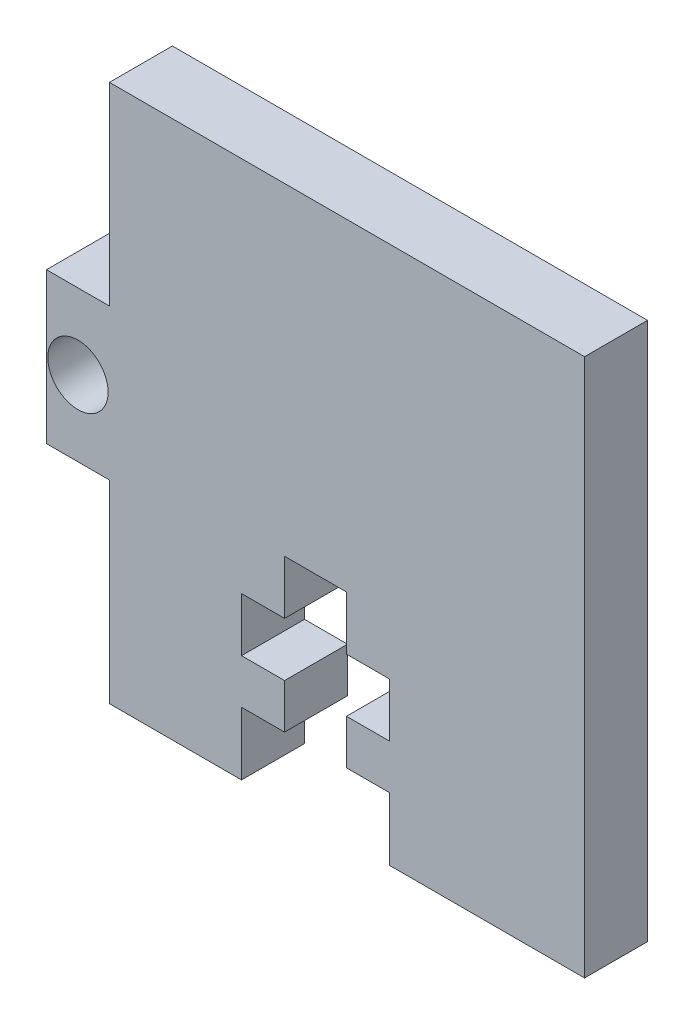
ISO-10303-21;
HEADER;
FILE_DESCRIPTION(('STEP AP214'),'2;1');
FILE_NAME('part.step','',(''),(''),'','','');
FILE_SCHEMA(('AUTOMOTIVE_DESIGN { 1 0 10303 214 1 1 1 1 }'));
ENDSEC;
DATA;
#1=APPLICATION_CONTEXT('core data for automotive mechanical design processes');
#2=APPLICATION_PROTOCOL_DEFINITION('international standard','automotive_design',2000,#1);
#3=PRODUCT_CONTEXT('',#1,'mechanical');
#4=PRODUCT('Part','Part','',(#3));
#5=PRODUCT_RELATED_PRODUCT_CATEGORY('part','',(#4));
#6=PRODUCT_DEFINITION_FORMATION('','',#4);
#7=PRODUCT_DEFINITION_CONTEXT('part definition',#1,'design');
#8=PRODUCT_DEFINITION('design','',#6,#7);
#9=PRODUCT_DEFINITION_SHAPE('','',#8);
#10=(LENGTH_UNIT() NAMED_UNIT(*) SI_UNIT(.MILLI.,.METRE.));
#11=(NAMED_UNIT(*) PLANE_ANGLE_UNIT() SI_UNIT($,.RADIAN.));
#12=(NAMED_UNIT(*) SI_UNIT($,.STERADIAN.) SOLID_ANGLE_UNIT());
#13=UNCERTAINTY_MEASURE_WITH_UNIT(LENGTH_MEASURE(1.E-05),#10,'distance_accuracy_value','');
#14=(GEOMETRIC_REPRESENTATION_CONTEXT(3) GLOBAL_UNCERTAINTY_ASSIGNED_CONTEXT((#13)) GLOBAL_UNIT_ASSIGNED_CONTEXT((#10,
#11,#12)) REPRESENTATION_CONTEXT('',''));
#15=CARTESIAN_POINT('',(0.,0.,0.));
#16=DIRECTION('',(0.,0.,1.));
#17=DIRECTION('',(1.,0.,0.));
#18=AXIS2_PLACEMENT_3D('',#15,#16,#17);
#19=CARTESIAN_POINT('',(0.,10.16,2.9718));
#20=DIRECTION('',(0.,1.,0.));
#21=DIRECTION('',(0.,0.,1.));
#22=AXIS2_PLACEMENT_3D('',#19,#20,#21);
#23=PLANE('',#22);
#24=DIRECTION('',(1.,0.,0.));
#25=VECTOR('',#24,1.);
#26=CARTESIAN_POINT('',(0.,10.16,0.));
#27=LINE('',#26,#25);
#28=CARTESIAN_POINT('',(11.2395,10.16,0.));
#29=VERTEX_POINT('',#28);
#30=CARTESIAN_POINT('',(14.1605,10.16,0.));
#31=VERTEX_POINT('',#30);
#32=EDGE_CURVE('E234',#29,#31,#27,.T.);
#33=ORIENTED_EDGE('',*,*,#32,.T.);
#34=DIRECTION('',(0.,0.,-1.));
#35=VECTOR('',#34,1.);
#36=CARTESIAN_POINT('',(14.1605,10.16,2.9718));
#37=LINE('',#36,#35);
#38=CARTESIAN_POINT('',(14.1605,10.16,2.9718));
#39=VERTEX_POINT('',#38);
#40=EDGE_CURVE('E11',#39,#31,#37,.T.);
#41=ORIENTED_EDGE('',*,*,#40,.F.);
#42=DIRECTION('',(1.,0.,0.));
#43=VECTOR('',#42,1.);
#44=CARTESIAN_POINT('',(0.,10.16,2.9718));
#45=LINE('',#44,#43);
#46=CARTESIAN_POINT('',(11.2395,10.16,2.9718));
#47=VERTEX_POINT('',#46);
#48=EDGE_CURVE('E143',#47,#39,#45,.T.);
#49=ORIENTED_EDGE('',*,*,#48,.F.);
#50=DIRECTION('',(0.,0.,-1.));
#51=VECTOR('',#50,1.);
#52=CARTESIAN_POINT('',(11.2395,10.16,2.9718));
#53=LINE('',#52,#51);
#54=EDGE_CURVE('E233',#47,#29,#53,.T.);
#55=ORIENTED_EDGE('',*,*,#54,.T.);
#56=EDGE_LOOP('',(#33,#41,#49,#55));
#57=FACE_BOUND('',#56,.T.);
#58=ADVANCED_FACE('F39',(#57),#23,.F.);
#59=CARTESIAN_POINT('',(14.1605,0.,2.9718));
#60=DIRECTION('',(-1.,0.,0.));
#61=DIRECTION('',(0.,0.,1.));
#62=AXIS2_PLACEMENT_3D('',#59,#60,#61);
#63=PLANE('',#62);
#64=DIRECTION('',(0.,1.,0.));
#65=VECTOR('',#64,1.);
#66=CARTESIAN_POINT('',(14.1605,0.,0.));
#67=LINE('',#66,#65);
#68=CARTESIAN_POINT('',(14.1605,7.62,0.));
#69=VERTEX_POINT('',#68);
#70=EDGE_CURVE('E237',#69,#31,#67,.T.);
#71=ORIENTED_EDGE('',*,*,#70,.F.);
#72=DIRECTION('',(0.,0.,-1.));
#73=VECTOR('',#72,1.);
#74=CARTESIAN_POINT('',(14.1605,7.62,2.9718));
#75=LINE('',#74,#73);
#76=CARTESIAN_POINT('',(14.1605,7.62,2.9718));
#77=VERTEX_POINT('',#76);
#78=EDGE_CURVE('E47',#77,#69,#75,.T.);
#79=ORIENTED_EDGE('',*,*,#78,.F.);
#80=DIRECTION('',(0.,1.,0.));
#81=VECTOR('',#80,1.);
#82=CARTESIAN_POINT('',(14.1605,0.,2.9718));
#83=LINE('',#82,#81);
#84=EDGE_CURVE('E363',#77,#39,#83,.T.);
#85=ORIENTED_EDGE('',*,*,#84,.T.);
#86=ORIENTED_EDGE('',*,*,#40,.T.);
#87=EDGE_LOOP('',(#71,#79,#85,#86));
#88=FACE_BOUND('',#87,.T.);
#89=ADVANCED_FACE('F349',(#88),#63,.T.);
#90=CARTESIAN_POINT('',(0.,7.61999999999999,2.9718));
#91=DIRECTION('',(0.,-1.,0.));
#92=DIRECTION('',(1.,0.,0.));
#93=AXIS2_PLACEMENT_3D('',#90,#91,#92);
#94=PLANE('',#93);
#95=DIRECTION('',(-1.,0.,0.));
#96=VECTOR('',#95,1.);
#97=CARTESIAN_POINT('',(0.,7.61999999999999,0.));
#98=LINE('',#97,#96);
#99=CARTESIAN_POINT('',(16.1925,7.62,0.));
#100=VERTEX_POINT('',#99);
#101=EDGE_CURVE('E240',#100,#69,#98,.T.);
#102=ORIENTED_EDGE('',*,*,#101,.F.);
#103=DIRECTION('',(0.,0.,-1.));
#104=VECTOR('',#103,1.);
#105=CARTESIAN_POINT('',(16.1925,7.62,2.9718));
#106=LINE('',#105,#104);
#107=CARTESIAN_POINT('',(16.1925,7.62,2.9718));
#108=VERTEX_POINT('',#107);
#109=EDGE_CURVE('E339',#108,#100,#106,.T.);
#110=ORIENTED_EDGE('',*,*,#109,.F.);
#111=DIRECTION('',(-1.,0.,0.));
#112=VECTOR('',#111,1.);
#113=CARTESIAN_POINT('',(0.,7.61999999999999,2.9718));
#114=LINE('',#113,#112);
#115=EDGE_CURVE('E346',#108,#77,#114,.T.);
#116=ORIENTED_EDGE('',*,*,#115,.T.);
#117=ORIENTED_EDGE('',*,*,#78,.T.);
#118=EDGE_LOOP('',(#102,#110,#116,#117));
#119=FACE_BOUND('',#118,.T.);
#120=ADVANCED_FACE('F344',(#119),#94,.T.);
#121=CARTESIAN_POINT('',(16.1925,0.,2.9718));
#122=DIRECTION('',(-1.,0.,0.));
#123=DIRECTION('',(0.,0.,1.));
#124=AXIS2_PLACEMENT_3D('',#121,#122,#123);
#125=PLANE('',#124);
#126=DIRECTION('',(0.,1.,0.));
#127=VECTOR('',#126,1.);
#128=CARTESIAN_POINT('',(16.1925,0.,0.));
#129=LINE('',#128,#127);
#130=CARTESIAN_POINT('',(16.1925,5.08,0.));
#131=VERTEX_POINT('',#130);
#132=EDGE_CURVE('E243',#131,#100,#129,.T.);
#133=ORIENTED_EDGE('',*,*,#132,.F.);
#134=DIRECTION('',(0.,0.,-1.));
#135=VECTOR('',#134,1.);
#136=CARTESIAN_POINT('',(16.1925,5.08,2.9718));
#137=LINE('',#136,#135);
#138=CARTESIAN_POINT('',(16.1925,5.08,2.9718));
#139=VERTEX_POINT('',#138);
#140=EDGE_CURVE('E337',#139,#131,#137,.T.);
#141=ORIENTED_EDGE('',*,*,#140,.F.);
#142=DIRECTION('',(0.,1.,0.));
#143=VECTOR('',#142,1.);
#144=CARTESIAN_POINT('',(16.1925,0.,2.9718));
#145=LINE('',#144,#143);
#146=EDGE_CURVE('E360',#139,#108,#145,.T.);
#147=ORIENTED_EDGE('',*,*,#146,.T.);
#148=ORIENTED_EDGE('',*,*,#109,.T.);
#149=EDGE_LOOP('',(#133,#141,#147,#148));
#150=FACE_BOUND('',#149,.T.);
#151=ADVANCED_FACE('F357',(#150),#125,.T.);
#152=CARTESIAN_POINT('',(0.,5.08,2.9718));
#153=DIRECTION('',(0.,1.,0.));
#154=DIRECTION('',(0.,0.,1.));
#155=AXIS2_PLACEMENT_3D('',#152,#153,#154);
#156=PLANE('',#155);
#157=DIRECTION('',(1.,0.,0.));
#158=VECTOR('',#157,1.);
#159=CARTESIAN_POINT('',(0.,5.08,0.));
#160=LINE('',#159,#158);
#161=CARTESIAN_POINT('',(14.1605,5.08,0.));
#162=VERTEX_POINT('',#161);
#163=EDGE_CURVE('E246',#162,#131,#160,.T.);
#164=ORIENTED_EDGE('',*,*,#163,.F.);
#165=DIRECTION('',(0.,0.,-1.));
#166=VECTOR('',#165,1.);
#167=CARTESIAN_POINT('',(14.1605,5.08,2.9718));
#168=LINE('',#167,#166);
#169=CARTESIAN_POINT('',(14.1605,5.08,2.9718));
#170=VERTEX_POINT('',#169);
#171=EDGE_CURVE('E335',#170,#162,#168,.T.);
#172=ORIENTED_EDGE('',*,*,#171,.F.);
#173=DIRECTION('',(1.,0.,0.));
#174=VECTOR('',#173,1.);
#175=CARTESIAN_POINT('',(0.,5.08,2.9718));
#176=LINE('',#175,#174);
#177=EDGE_CURVE('E365',#170,#139,#176,.T.);
#178=ORIENTED_EDGE('',*,*,#177,.T.);
#179=ORIENTED_EDGE('',*,*,#140,.T.);
#180=EDGE_LOOP('',(#164,#172,#178,#179));
#181=FACE_BOUND('',#180,.T.);
#182=ADVANCED_FACE('F438',(#181),#156,.T.);
#183=CARTESIAN_POINT('',(14.1605,0.,2.9718));
#184=DIRECTION('',(-1.,0.,0.));
#185=DIRECTION('',(0.,0.,1.));
#186=AXIS2_PLACEMENT_3D('',#183,#184,#185);
#187=PLANE('',#186);
#188=DIRECTION('',(0.,1.,0.));
#189=VECTOR('',#188,1.);
#190=CARTESIAN_POINT('',(14.1605,0.,0.));
#191=LINE('',#190,#189);
#192=CARTESIAN_POINT('',(14.1605,2.9718,0.));
#193=VERTEX_POINT('',#192);
#194=EDGE_CURVE('E249',#193,#162,#191,.T.);
#195=ORIENTED_EDGE('',*,*,#194,.F.);
#196=DIRECTION('',(0.,0.,-1.));
#197=VECTOR('',#196,1.);
#198=CARTESIAN_POINT('',(14.1605,2.9718,2.9718));
#199=LINE('',#198,#197);
#200=CARTESIAN_POINT('',(14.1605,2.9718,2.9718));
#201=VERTEX_POINT('',#200);
#202=EDGE_CURVE('E333',#201,#193,#199,.T.);
#203=ORIENTED_EDGE('',*,*,#202,.F.);
#204=DIRECTION('',(0.,1.,0.));
#205=VECTOR('',#204,1.);
#206=CARTESIAN_POINT('',(14.1605,0.,2.9718));
#207=LINE('',#206,#205);
#208=EDGE_CURVE('E371',#201,#170,#207,.T.);
#209=ORIENTED_EDGE('',*,*,#208,.T.);
#210=ORIENTED_EDGE('',*,*,#171,.T.);
#211=EDGE_LOOP('',(#195,#203,#209,#210));
#212=FACE_BOUND('',#211,.T.);
#213=ADVANCED_FACE('F441',(#212),#187,.T.);
#214=CARTESIAN_POINT('',(0.,2.9718,2.9718));
#215=DIRECTION('',(0.,-1.,0.));
#216=DIRECTION('',(1.,0.,0.));
#217=AXIS2_PLACEMENT_3D('',#214,#215,#216);
#218=PLANE('',#217);
#219=DIRECTION('',(-1.,0.,0.));
#220=VECTOR('',#219,1.);
#221=CARTESIAN_POINT('',(0.,2.9718,0.));
#222=LINE('',#221,#220);
#223=CARTESIAN_POINT('',(16.1925,2.9718,0.));
#224=VERTEX_POINT('',#223);
#225=EDGE_CURVE('E252',#224,#193,#222,.T.);
#226=ORIENTED_EDGE('',*,*,#225,.F.);
#227=DIRECTION('',(0.,0.,-1.));
#228=VECTOR('',#227,1.);
#229=CARTESIAN_POINT('',(16.1925,2.9718,2.9718));
#230=LINE('',#229,#228);
#231=CARTESIAN_POINT('',(16.1925,2.9718,2.9718));
#232=VERTEX_POINT('',#231);
#233=EDGE_CURVE('E331',#232,#224,#230,.T.);
#234=ORIENTED_EDGE('',*,*,#233,.F.);
#235=DIRECTION('',(-1.,0.,0.));
#236=VECTOR('',#235,1.);
#237=CARTESIAN_POINT('',(0.,2.9718,2.9718));
#238=LINE('',#237,#236);
#239=EDGE_CURVE('E374',#232,#201,#238,.T.);
#240=ORIENTED_EDGE('',*,*,#239,.T.);
#241=ORIENTED_EDGE('',*,*,#202,.T.);
#242=EDGE_LOOP('',(#226,#234,#240,#241));
#243=FACE_BOUND('',#242,.T.);
#244=ADVANCED_FACE('F445',(#243),#218,.T.);
#245=CARTESIAN_POINT('',(16.1925,0.,2.9718));
#246=DIRECTION('',(-1.,0.,0.));
#247=DIRECTION('',(0.,-1.,0.));
#248=AXIS2_PLACEMENT_3D('',#245,#246,#247);
#249=PLANE('',#248);
#250=DIRECTION('',(0.,1.,0.));
#251=VECTOR('',#250,1.);
#252=CARTESIAN_POINT('',(16.1925,0.,0.));
#253=LINE('',#252,#251);
#254=CARTESIAN_POINT('',(16.1925,0.,0.));
#255=VERTEX_POINT('',#254);
#256=EDGE_CURVE('E255',#255,#224,#253,.T.);
#257=ORIENTED_EDGE('',*,*,#256,.F.);
#258=DIRECTION('',(0.,0.,-1.));
#259=VECTOR('',#258,1.);
#260=CARTESIAN_POINT('',(16.1925,0.,2.9718));
#261=LINE('',#260,#259);
#262=CARTESIAN_POINT('',(16.1925,0.,2.9718));
#263=VERTEX_POINT('',#262);
#264=EDGE_CURVE('E329',#263,#255,#261,.T.);
#265=ORIENTED_EDGE('',*,*,#264,.F.);
#266=DIRECTION('',(0.,1.,0.));
#267=VECTOR('',#266,1.);
#268=CARTESIAN_POINT('',(16.1925,0.,2.9718));
#269=LINE('',#268,#267);
#270=EDGE_CURVE('E377',#263,#232,#269,.T.);
#271=ORIENTED_EDGE('',*,*,#270,.T.);
#272=ORIENTED_EDGE('',*,*,#233,.T.);
#273=EDGE_LOOP('',(#257,#265,#271,#272));
#274=FACE_BOUND('',#273,.T.);
#275=ADVANCED_FACE('F449',(#274),#249,.T.);
#276=CARTESIAN_POINT('',(0.,0.,2.9718));
#277=DIRECTION('',(0.,1.,0.));
#278=DIRECTION('',(0.,0.,1.));
#279=AXIS2_PLACEMENT_3D('',#276,#277,#278);
#280=PLANE('',#279);
#281=DIRECTION('',(1.,0.,0.));
#282=VECTOR('',#281,1.);
#283=CARTESIAN_POINT('',(0.,0.,0.));
#284=LINE('',#283,#282);
#285=CARTESIAN_POINT('',(25.4,0.,0.));
#286=VERTEX_POINT('',#285);
#287=EDGE_CURVE('E258',#255,#286,#284,.T.);
#288=ORIENTED_EDGE('',*,*,#287,.T.);
#289=DIRECTION('',(0.,0.,-1.));
#290=VECTOR('',#289,1.);
#291=CARTESIAN_POINT('',(25.4,0.,2.9718));
#292=LINE('',#291,#290);
#293=CARTESIAN_POINT('',(25.4,0.,2.9718));
#294=VERTEX_POINT('',#293);
#295=EDGE_CURVE('E326',#294,#286,#292,.T.);
#296=ORIENTED_EDGE('',*,*,#295,.F.);
#297=DIRECTION('',(1.,0.,0.));
#298=VECTOR('',#297,1.);
#299=CARTESIAN_POINT('',(0.,0.,2.9718));
#300=LINE('',#299,#298);
#301=EDGE_CURVE('E380',#263,#294,#300,.T.);
#302=ORIENTED_EDGE('',*,*,#301,.F.);
#303=ORIENTED_EDGE('',*,*,#264,.T.);
#304=EDGE_LOOP('',(#288,#296,#302,#303));
#305=FACE_BOUND('',#304,.T.);
#306=ADVANCED_FACE('F453',(#305),#280,.F.);
#307=CARTESIAN_POINT('',(25.4,0.,2.9718));
#308=DIRECTION('',(-1.,0.,0.));
#309=DIRECTION('',(0.,0.,1.));
#310=AXIS2_PLACEMENT_3D('',#307,#308,#309);
#311=PLANE('',#310);
#312=DIRECTION('',(0.,1.,0.));
#313=VECTOR('',#312,1.);
#314=CARTESIAN_POINT('',(25.4,0.,0.));
#315=LINE('',#314,#313);
#316=CARTESIAN_POINT('',(25.4,25.4,0.));
#317=VERTEX_POINT('',#316);
#318=EDGE_CURVE('E260',#286,#317,#315,.T.);
#319=ORIENTED_EDGE('',*,*,#318,.T.);
#320=DIRECTION('',(0.,0.,-1.));
#321=VECTOR('',#320,1.);
#322=CARTESIAN_POINT('',(25.4,25.4,2.9718));
#323=LINE('',#322,#321);
#324=CARTESIAN_POINT('',(25.4,25.4,2.9718));
#325=VERTEX_POINT('',#324);
#326=EDGE_CURVE('E324',#325,#317,#323,.T.);
#327=ORIENTED_EDGE('',*,*,#326,.F.);
#328=DIRECTION('',(0.,1.,0.));
#329=VECTOR('',#328,1.);
#330=CARTESIAN_POINT('',(25.4,0.,2.9718));
#331=LINE('',#330,#329);
#332=EDGE_CURVE('E382',#294,#325,#331,.T.);
#333=ORIENTED_EDGE('',*,*,#332,.F.);
#334=ORIENTED_EDGE('',*,*,#295,.T.);
#335=EDGE_LOOP('',(#319,#327,#333,#334));
#336=FACE_BOUND('',#335,.T.);
#337=ADVANCED_FACE('F457',(#336),#311,.F.);
#338=CARTESIAN_POINT('',(0.,25.4,2.9718));
#339=DIRECTION('',(0.,1.,0.));
#340=DIRECTION('',(0.,0.,1.));
#341=AXIS2_PLACEMENT_3D('',#338,#339,#340);
#342=PLANE('',#341);
#343=DIRECTION('',(1.,0.,0.));
#344=VECTOR('',#343,1.);
#345=CARTESIAN_POINT('',(0.,25.4,0.));
#346=LINE('',#345,#344);
#347=CARTESIAN_POINT('',(2.9718,25.4,0.));
#348=VERTEX_POINT('',#347);
#349=EDGE_CURVE('E263',#348,#317,#346,.T.);
#350=ORIENTED_EDGE('',*,*,#349,.F.);
#351=DIRECTION('',(0.,0.,-1.));
#352=VECTOR('',#351,1.);
#353=CARTESIAN_POINT('',(2.9718,25.4,2.9718));
#354=LINE('',#353,#352);
#355=CARTESIAN_POINT('',(2.9718,25.4,2.9718));
#356=VERTEX_POINT('',#355);
#357=EDGE_CURVE('E322',#356,#348,#354,.T.);
#358=ORIENTED_EDGE('',*,*,#357,.F.);
#359=DIRECTION('',(1.,0.,0.));
#360=VECTOR('',#359,1.);
#361=CARTESIAN_POINT('',(0.,25.4,2.9718));
#362=LINE('',#361,#360);
#363=EDGE_CURVE('E384',#356,#325,#362,.T.);
#364=ORIENTED_EDGE('',*,*,#363,.T.);
#365=ORIENTED_EDGE('',*,*,#326,.T.);
#366=EDGE_LOOP('',(#350,#358,#364,#365));
#367=FACE_BOUND('',#366,.T.);
#368=ADVANCED_FACE('F461',(#367),#342,.T.);
#369=CARTESIAN_POINT('',(2.9718,0.,2.9718));
#370=DIRECTION('',(1.,0.,0.));
#371=DIRECTION('',(0.,1.,0.));
#372=AXIS2_PLACEMENT_3D('',#369,#370,#371);
#373=PLANE('',#372);
#374=DIRECTION('',(0.,-1.,0.));
#375=VECTOR('',#374,1.);
#376=CARTESIAN_POINT('',(2.9718,0.,0.));
#377=LINE('',#376,#375);
#378=CARTESIAN_POINT('',(2.9718,16.256,0.));
#379=VERTEX_POINT('',#378);
#380=EDGE_CURVE('E266',#348,#379,#377,.T.);
#381=ORIENTED_EDGE('',*,*,#380,.T.);
#382=DIRECTION('',(0.,0.,-1.));
#383=VECTOR('',#382,1.);
#384=CARTESIAN_POINT('',(2.9718,16.256,2.9718));
#385=LINE('',#384,#383);
#386=CARTESIAN_POINT('',(2.9718,16.256,2.9718));
#387=VERTEX_POINT('',#386);
#388=EDGE_CURVE('E319',#387,#379,#385,.T.);
#389=ORIENTED_EDGE('',*,*,#388,.F.);
#390=DIRECTION('',(0.,-1.,0.));
#391=VECTOR('',#390,1.);
#392=CARTESIAN_POINT('',(2.9718,0.,2.9718));
#393=LINE('',#392,#391);
#394=EDGE_CURVE('E387',#356,#387,#393,.T.);
#395=ORIENTED_EDGE('',*,*,#394,.F.);
#396=ORIENTED_EDGE('',*,*,#357,.T.);
#397=EDGE_LOOP('',(#381,#389,#395,#396));
#398=FACE_BOUND('',#397,.T.);
#399=ADVANCED_FACE('F465',(#398),#373,.F.);
#400=CARTESIAN_POINT('',(0.,16.256,2.9718));
#401=DIRECTION('',(0.,-1.,0.));
#402=DIRECTION('',(0.,0.,-1.));
#403=AXIS2_PLACEMENT_3D('',#400,#401,#402);
#404=PLANE('',#403);
#405=DIRECTION('',(-1.,0.,0.));
#406=VECTOR('',#405,1.);
#407=CARTESIAN_POINT('',(0.,16.256,0.));
#408=LINE('',#407,#406);
#409=CARTESIAN_POINT('',(0.,16.256,0.));
#410=VERTEX_POINT('',#409);
#411=EDGE_CURVE('E268',#379,#410,#408,.T.);
#412=ORIENTED_EDGE('',*,*,#411,.T.);
#413=DIRECTION('',(0.,0.,-1.));
#414=VECTOR('',#413,1.);
#415=CARTESIAN_POINT('',(0.,16.256,2.9718));
#416=LINE('',#415,#414);
#417=CARTESIAN_POINT('',(0.,16.256,2.9718));
#418=VERTEX_POINT('',#417);
#419=EDGE_CURVE('E317',#418,#410,#416,.T.);
#420=ORIENTED_EDGE('',*,*,#419,.F.);
#421=DIRECTION('',(-1.,0.,0.));
#422=VECTOR('',#421,1.);
#423=CARTESIAN_POINT('',(0.,16.256,2.9718));
#424=LINE('',#423,#422);
#425=EDGE_CURVE('E389',#387,#418,#424,.T.);
#426=ORIENTED_EDGE('',*,*,#425,.F.);
#427=ORIENTED_EDGE('',*,*,#388,.T.);
#428=EDGE_LOOP('',(#412,#420,#426,#427));
#429=FACE_BOUND('',#428,.T.);
#430=ADVANCED_FACE('F469',(#429),#404,.F.);
#431=CARTESIAN_POINT('',(0.,0.,2.9718));
#432=DIRECTION('',(-1.,0.,0.));
#433=DIRECTION('',(0.,0.,1.));
#434=AXIS2_PLACEMENT_3D('',#431,#432,#433);
#435=PLANE('',#434);
#436=DIRECTION('',(0.,1.,0.));
#437=VECTOR('',#436,1.);
#438=CARTESIAN_POINT('',(0.,0.,0.));
#439=LINE('',#438,#437);
#440=CARTESIAN_POINT('',(0.,9.144,0.));
#441=VERTEX_POINT('',#440);
#442=EDGE_CURVE('E271',#441,#410,#439,.T.);
#443=ORIENTED_EDGE('',*,*,#442,.F.);
#444=DIRECTION('',(0.,0.,-1.));
#445=VECTOR('',#444,1.);
#446=CARTESIAN_POINT('',(0.,9.144,2.9718));
#447=LINE('',#446,#445);
#448=CARTESIAN_POINT('',(0.,9.144,2.9718));
#449=VERTEX_POINT('',#448);
#450=EDGE_CURVE('E315',#449,#441,#447,.T.);
#451=ORIENTED_EDGE('',*,*,#450,.F.);
#452=DIRECTION('',(0.,1.,0.));
#453=VECTOR('',#452,1.);
#454=CARTESIAN_POINT('',(0.,0.,2.9718));
#455=LINE('',#454,#453);
#456=EDGE_CURVE('E391',#449,#418,#455,.T.);
#457=ORIENTED_EDGE('',*,*,#456,.T.);
#458=ORIENTED_EDGE('',*,*,#419,.T.);
#459=EDGE_LOOP('',(#443,#451,#457,#458));
#460=FACE_BOUND('',#459,.T.);
#461=ADVANCED_FACE('F473',(#460),#435,.T.);
#462=CARTESIAN_POINT('',(0.,9.144,2.9718));
#463=DIRECTION('',(0.,1.,0.));
#464=DIRECTION('',(0.,0.,1.));
#465=AXIS2_PLACEMENT_3D('',#462,#463,#464);
#466=PLANE('',#465);
#467=DIRECTION('',(1.,0.,0.));
#468=VECTOR('',#467,1.);
#469=CARTESIAN_POINT('',(0.,9.144,0.));
#470=LINE('',#469,#468);
#471=CARTESIAN_POINT('',(2.9718,9.144,0.));
#472=VERTEX_POINT('',#471);
#473=EDGE_CURVE('E274',#441,#472,#470,.T.);
#474=ORIENTED_EDGE('',*,*,#473,.T.);
#475=DIRECTION('',(0.,0.,-1.));
#476=VECTOR('',#475,1.);
#477=CARTESIAN_POINT('',(2.9718,9.144,2.9718));
#478=LINE('',#477,#476);
#479=CARTESIAN_POINT('',(2.9718,9.144,2.9718));
#480=VERTEX_POINT('',#479);
#481=EDGE_CURVE('E312',#480,#472,#478,.T.);
#482=ORIENTED_EDGE('',*,*,#481,.F.);
#483=DIRECTION('',(1.,0.,0.));
#484=VECTOR('',#483,1.);
#485=CARTESIAN_POINT('',(0.,9.144,2.9718));
#486=LINE('',#485,#484);
#487=EDGE_CURVE('E394',#449,#480,#486,.T.);
#488=ORIENTED_EDGE('',*,*,#487,.F.);
#489=ORIENTED_EDGE('',*,*,#450,.T.);
#490=EDGE_LOOP('',(#474,#482,#488,#489));
#491=FACE_BOUND('',#490,.T.);
#492=ADVANCED_FACE('F477',(#491),#466,.F.);
#493=CARTESIAN_POINT('',(2.9718,0.,2.9718));
#494=DIRECTION('',(1.,0.,0.));
#495=DIRECTION('',(0.,1.,0.));
#496=AXIS2_PLACEMENT_3D('',#493,#494,#495);
#497=PLANE('',#496);
#498=DIRECTION('',(0.,-1.,0.));
#499=VECTOR('',#498,1.);
#500=CARTESIAN_POINT('',(2.9718,0.,0.));
#501=LINE('',#500,#499);
#502=CARTESIAN_POINT('',(2.9718,0.,0.));
#503=VERTEX_POINT('',#502);
#504=EDGE_CURVE('E276',#472,#503,#501,.T.);
#505=ORIENTED_EDGE('',*,*,#504,.T.);
#506=DIRECTION('',(0.,0.,-1.));
#507=VECTOR('',#506,1.);
#508=CARTESIAN_POINT('',(2.9718,0.,2.9718));
#509=LINE('',#508,#507);
#510=CARTESIAN_POINT('',(2.9718,0.,2.9718));
#511=VERTEX_POINT('',#510);
#512=EDGE_CURVE('E309',#511,#503,#509,.T.);
#513=ORIENTED_EDGE('',*,*,#512,.F.);
#514=DIRECTION('',(0.,-1.,0.));
#515=VECTOR('',#514,1.);
#516=CARTESIAN_POINT('',(2.9718,0.,2.9718));
#517=LINE('',#516,#515);
#518=EDGE_CURVE('E396',#480,#511,#517,.T.);
#519=ORIENTED_EDGE('',*,*,#518,.F.);
#520=ORIENTED_EDGE('',*,*,#481,.T.);
#521=EDGE_LOOP('',(#505,#513,#519,#520));
#522=FACE_BOUND('',#521,.T.);
#523=ADVANCED_FACE('F481',(#522),#497,.F.);
#524=CARTESIAN_POINT('',(0.,0.,2.9718));
#525=DIRECTION('',(0.,1.,0.));
#526=DIRECTION('',(0.,0.,1.));
#527=AXIS2_PLACEMENT_3D('',#524,#525,#526);
#528=PLANE('',#527);
#529=DIRECTION('',(1.,0.,0.));
#530=VECTOR('',#529,1.);
#531=CARTESIAN_POINT('',(0.,0.,0.));
#532=LINE('',#531,#530);
#533=CARTESIAN_POINT('',(9.2075,0.,0.));
#534=VERTEX_POINT('',#533);
#535=EDGE_CURVE('E278',#503,#534,#532,.T.);
#536=ORIENTED_EDGE('',*,*,#535,.T.);
#537=DIRECTION('',(0.,0.,-1.));
#538=VECTOR('',#537,1.);
#539=CARTESIAN_POINT('',(9.2075,0.,2.9718));
#540=LINE('',#539,#538);
#541=CARTESIAN_POINT('',(9.2075,0.,2.9718));
#542=VERTEX_POINT('',#541);
#543=EDGE_CURVE('E306',#542,#534,#540,.T.);
#544=ORIENTED_EDGE('',*,*,#543,.F.);
#545=DIRECTION('',(1.,0.,0.));
#546=VECTOR('',#545,1.);
#547=CARTESIAN_POINT('',(0.,0.,2.9718));
#548=LINE('',#547,#546);
#549=EDGE_CURVE('E398',#511,#542,#548,.T.);
#550=ORIENTED_EDGE('',*,*,#549,.F.);
#551=ORIENTED_EDGE('',*,*,#512,.T.);
#552=EDGE_LOOP('',(#536,#544,#550,#551));
#553=FACE_BOUND('',#552,.T.);
#554=ADVANCED_FACE('F485',(#553),#528,.F.);
#555=CARTESIAN_POINT('',(9.2075,0.,2.9718));
#556=DIRECTION('',(-1.,0.,0.));
#557=DIRECTION('',(0.,0.,1.));
#558=AXIS2_PLACEMENT_3D('',#555,#556,#557);
#559=PLANE('',#558);
#560=DIRECTION('',(0.,1.,0.));
#561=VECTOR('',#560,1.);
#562=CARTESIAN_POINT('',(9.2075,0.,0.));
#563=LINE('',#562,#561);
#564=CARTESIAN_POINT('',(9.2075,2.9718,0.));
#565=VERTEX_POINT('',#564);
#566=EDGE_CURVE('E280',#534,#565,#563,.T.);
#567=ORIENTED_EDGE('',*,*,#566,.T.);
#568=DIRECTION('',(0.,0.,-1.));
#569=VECTOR('',#568,1.);
#570=CARTESIAN_POINT('',(9.2075,2.9718,2.9718));
#571=LINE('',#570,#569);
#572=CARTESIAN_POINT('',(9.2075,2.9718,2.9718));
#573=VERTEX_POINT('',#572);
#574=EDGE_CURVE('E303',#573,#565,#571,.T.);
#575=ORIENTED_EDGE('',*,*,#574,.F.);
#576=DIRECTION('',(0.,1.,0.));
#577=VECTOR('',#576,1.);
#578=CARTESIAN_POINT('',(9.2075,0.,2.9718));
#579=LINE('',#578,#577);
#580=EDGE_CURVE('E400',#542,#573,#579,.T.);
#581=ORIENTED_EDGE('',*,*,#580,.F.);
#582=ORIENTED_EDGE('',*,*,#543,.T.);
#583=EDGE_LOOP('',(#567,#575,#581,#582));
#584=FACE_BOUND('',#583,.T.);
#585=ADVANCED_FACE('F489',(#584),#559,.F.);
#586=CARTESIAN_POINT('',(0.,2.9718,2.9718));
#587=DIRECTION('',(0.,1.,0.));
#588=DIRECTION('',(0.,0.,1.));
#589=AXIS2_PLACEMENT_3D('',#586,#587,#588);
#590=PLANE('',#589);
#591=DIRECTION('',(1.,0.,0.));
#592=VECTOR('',#591,1.);
#593=CARTESIAN_POINT('',(0.,2.9718,0.));
#594=LINE('',#593,#592);
#595=CARTESIAN_POINT('',(11.2395,2.9718,0.));
#596=VERTEX_POINT('',#595);
#597=EDGE_CURVE('E282',#565,#596,#594,.T.);
#598=ORIENTED_EDGE('',*,*,#597,.T.);
#599=DIRECTION('',(0.,0.,-1.));
#600=VECTOR('',#599,1.);
#601=CARTESIAN_POINT('',(11.2395,2.9718,2.9718));
#602=LINE('',#601,#600);
#603=CARTESIAN_POINT('',(11.2395,2.9718,2.9718));
#604=VERTEX_POINT('',#603);
#605=EDGE_CURVE('E300',#604,#596,#602,.T.);
#606=ORIENTED_EDGE('',*,*,#605,.F.);
#607=DIRECTION('',(1.,0.,0.));
#608=VECTOR('',#607,1.);
#609=CARTESIAN_POINT('',(0.,2.9718,2.9718));
#610=LINE('',#609,#608);
#611=EDGE_CURVE('E402',#573,#604,#610,.T.);
#612=ORIENTED_EDGE('',*,*,#611,.F.);
#613=ORIENTED_EDGE('',*,*,#574,.T.);
#614=EDGE_LOOP('',(#598,#606,#612,#613));
#615=FACE_BOUND('',#614,.T.);
#616=ADVANCED_FACE('F493',(#615),#590,.F.);
#617=CARTESIAN_POINT('',(11.2395,0.,2.9718));
#618=DIRECTION('',(-1.,0.,0.));
#619=DIRECTION('',(0.,0.,1.));
#620=AXIS2_PLACEMENT_3D('',#617,#618,#619);
#621=PLANE('',#620);
#622=DIRECTION('',(0.,1.,0.));
#623=VECTOR('',#622,1.);
#624=CARTESIAN_POINT('',(11.2395,0.,0.));
#625=LINE('',#624,#623);
#626=CARTESIAN_POINT('',(11.2395,5.08,0.));
#627=VERTEX_POINT('',#626);
#628=EDGE_CURVE('E284',#596,#627,#625,.T.);
#629=ORIENTED_EDGE('',*,*,#628,.T.);
#630=DIRECTION('',(0.,0.,-1.));
#631=VECTOR('',#630,1.);
#632=CARTESIAN_POINT('',(11.2395,5.08,2.9718));
#633=LINE('',#632,#631);
#634=CARTESIAN_POINT('',(11.2395,5.08,2.9718));
#635=VERTEX_POINT('',#634);
#636=EDGE_CURVE('E297',#635,#627,#633,.T.);
#637=ORIENTED_EDGE('',*,*,#636,.F.);
#638=DIRECTION('',(0.,1.,0.));
#639=VECTOR('',#638,1.);
#640=CARTESIAN_POINT('',(11.2395,0.,2.9718));
#641=LINE('',#640,#639);
#642=EDGE_CURVE('E404',#604,#635,#641,.T.);
#643=ORIENTED_EDGE('',*,*,#642,.F.);
#644=ORIENTED_EDGE('',*,*,#605,.T.);
#645=EDGE_LOOP('',(#629,#637,#643,#644));
#646=FACE_BOUND('',#645,.T.);
#647=ADVANCED_FACE('F410',(#646),#621,.F.);
#648=CARTESIAN_POINT('',(0.,5.07999999999999,2.9718));
#649=DIRECTION('',(0.,-1.,0.));
#650=DIRECTION('',(1.,0.,0.));
#651=AXIS2_PLACEMENT_3D('',#648,#649,#650);
#652=PLANE('',#651);
#653=DIRECTION('',(-1.,0.,0.));
#654=VECTOR('',#653,1.);
#655=CARTESIAN_POINT('',(0.,5.07999999999999,0.));
#656=LINE('',#655,#654);
#657=CARTESIAN_POINT('',(9.2075,5.08,0.));
#658=VERTEX_POINT('',#657);
#659=EDGE_CURVE('E286',#627,#658,#656,.T.);
#660=ORIENTED_EDGE('',*,*,#659,.T.);
#661=DIRECTION('',(0.,0.,-1.));
#662=VECTOR('',#661,1.);
#663=CARTESIAN_POINT('',(9.2075,5.08,2.9718));
#664=LINE('',#663,#662);
#665=CARTESIAN_POINT('',(9.2075,5.08,2.9718));
#666=VERTEX_POINT('',#665);
#667=EDGE_CURVE('E222',#666,#658,#664,.T.);
#668=ORIENTED_EDGE('',*,*,#667,.F.);
#669=DIRECTION('',(-1.,0.,0.));
#670=VECTOR('',#669,1.);
#671=CARTESIAN_POINT('',(0.,5.07999999999999,2.9718));
#672=LINE('',#671,#670);
#673=EDGE_CURVE('E213',#635,#666,#672,.T.);
#674=ORIENTED_EDGE('',*,*,#673,.F.);
#675=ORIENTED_EDGE('',*,*,#636,.T.);
#676=EDGE_LOOP('',(#660,#668,#674,#675));
#677=FACE_BOUND('',#676,.T.);
#678=ADVANCED_FACE('F414',(#677),#652,.F.);
#679=CARTESIAN_POINT('',(9.2075,0.,2.9718));
#680=DIRECTION('',(-1.,0.,0.));
#681=DIRECTION('',(0.,0.,1.));
#682=AXIS2_PLACEMENT_3D('',#679,#680,#681);
#683=PLANE('',#682);
#684=DIRECTION('',(0.,1.,0.));
#685=VECTOR('',#684,1.);
#686=CARTESIAN_POINT('',(9.2075,0.,0.));
#687=LINE('',#686,#685);
#688=CARTESIAN_POINT('',(9.2075,7.62,0.));
#689=VERTEX_POINT('',#688);
#690=EDGE_CURVE('E221',#658,#689,#687,.T.);
#691=ORIENTED_EDGE('',*,*,#690,.T.);
#692=DIRECTION('',(0.,0.,-1.));
#693=VECTOR('',#692,1.);
#694=CARTESIAN_POINT('',(9.2075,7.62,2.9718));
#695=LINE('',#694,#693);
#696=CARTESIAN_POINT('',(9.2075,7.62,2.9718));
#697=VERTEX_POINT('',#696);
#698=EDGE_CURVE('E218',#697,#689,#695,.T.);
#699=ORIENTED_EDGE('',*,*,#698,.F.);
#700=DIRECTION('',(0.,1.,0.));
#701=VECTOR('',#700,1.);
#702=CARTESIAN_POINT('',(9.2075,0.,2.9718));
#703=LINE('',#702,#701);
#704=EDGE_CURVE('E206',#666,#697,#703,.T.);
#705=ORIENTED_EDGE('',*,*,#704,.F.);
#706=ORIENTED_EDGE('',*,*,#667,.T.);
#707=EDGE_LOOP('',(#691,#699,#705,#706));
#708=FACE_BOUND('',#707,.T.);
#709=ADVANCED_FACE('F219',(#708),#683,.F.);
#710=CARTESIAN_POINT('',(0.,7.62,2.9718));
#711=DIRECTION('',(0.,1.,0.));
#712=DIRECTION('',(0.,0.,1.));
#713=AXIS2_PLACEMENT_3D('',#710,#711,#712);
#714=PLANE('',#713);
#715=DIRECTION('',(1.,0.,0.));
#716=VECTOR('',#715,1.);
#717=CARTESIAN_POINT('',(0.,7.62,0.));
#718=LINE('',#717,#716);
#719=CARTESIAN_POINT('',(11.2395,7.62,0.));
#720=VERTEX_POINT('',#719);
#721=EDGE_CURVE('E131',#689,#720,#718,.T.);
#722=ORIENTED_EDGE('',*,*,#721,.T.);
#723=DIRECTION('',(0.,0.,-1.));
#724=VECTOR('',#723,1.);
#725=CARTESIAN_POINT('',(11.2395,7.62,2.9718));
#726=LINE('',#725,#724);
#727=CARTESIAN_POINT('',(11.2395,7.62,2.9718));
#728=VERTEX_POINT('',#727);
#729=EDGE_CURVE('E223',#728,#720,#726,.T.);
#730=ORIENTED_EDGE('',*,*,#729,.F.);
#731=DIRECTION('',(1.,0.,0.));
#732=VECTOR('',#731,1.);
#733=CARTESIAN_POINT('',(0.,7.62,2.9718));
#734=LINE('',#733,#732);
#735=EDGE_CURVE('E211',#697,#728,#734,.T.);
#736=ORIENTED_EDGE('',*,*,#735,.F.);
#737=ORIENTED_EDGE('',*,*,#698,.T.);
#738=EDGE_LOOP('',(#722,#730,#736,#737));
#739=FACE_BOUND('',#738,.T.);
#740=ADVANCED_FACE('F225',(#739),#714,.F.);
#741=CARTESIAN_POINT('',(11.2395,0.,2.9718));
#742=DIRECTION('',(-1.,0.,0.));
#743=DIRECTION('',(0.,0.,1.));
#744=AXIS2_PLACEMENT_3D('',#741,#742,#743);
#745=PLANE('',#744);
#746=DIRECTION('',(0.,1.,0.));
#747=VECTOR('',#746,1.);
#748=CARTESIAN_POINT('',(11.2395,0.,0.));
#749=LINE('',#748,#747);
#750=EDGE_CURVE('E137',#720,#29,#749,.T.);
#751=ORIENTED_EDGE('',*,*,#750,.T.);
#752=ORIENTED_EDGE('',*,*,#54,.F.);
#753=DIRECTION('',(0.,1.,0.));
#754=VECTOR('',#753,1.);
#755=CARTESIAN_POINT('',(11.2395,0.,2.9718));
#756=LINE('',#755,#754);
#757=EDGE_CURVE('E55',#728,#47,#756,.T.);
#758=ORIENTED_EDGE('',*,*,#757,.F.);
#759=ORIENTED_EDGE('',*,*,#729,.T.);
#760=EDGE_LOOP('',(#751,#752,#758,#759));
#761=FACE_BOUND('',#760,.T.);
#762=ADVANCED_FACE('F416',(#761),#745,.F.);
#763=CARTESIAN_POINT('',(1.4859,12.7,2.9718));
#764=DIRECTION('',(0.,0.,-1.));
#765=DIRECTION('',(-1.,0.,0.));
#766=AXIS2_PLACEMENT_3D('',#763,#764,#765);
#767=CYLINDRICAL_SURFACE('',#766,1.4224);
#768=CARTESIAN_POINT('',(1.4859,12.7,2.9718));
#769=DIRECTION('',(0.,0.,1.));
#770=DIRECTION('',(1.,0.,0.));
#771=AXIS2_PLACEMENT_3D('',#768,#769,#770);
#772=CIRCLE('',#771,1.4224);
#773=CARTESIAN_POINT('',(2.9083,12.7,2.9718));
#774=VERTEX_POINT('',#773);
#775=EDGE_CURVE('E227',#774,#774,#772,.T.);
#776=ORIENTED_EDGE('',*,*,#775,.T.);
#777=EDGE_LOOP('',(#776));
#778=FACE_BOUND('',#777,.T.);
#779=CARTESIAN_POINT('',(1.4859,12.7,0.));
#780=DIRECTION('',(0.,0.,1.));
#781=DIRECTION('',(1.,0.,0.));
#782=AXIS2_PLACEMENT_3D('',#779,#780,#781);
#783=CIRCLE('',#782,1.4224);
#784=CARTESIAN_POINT('',(2.9083,12.7,0.));
#785=VERTEX_POINT('',#784);
#786=EDGE_CURVE('E291',#785,#785,#783,.T.);
#787=ORIENTED_EDGE('',*,*,#786,.F.);
#788=EDGE_LOOP('',(#787));
#789=FACE_BOUND('',#788,.T.);
#790=ADVANCED_FACE('F418',(#778,#789),#767,.F.);
#791=CARTESIAN_POINT('',(0.,0.,2.9718));
#792=DIRECTION('',(0.,0.,1.));
#793=DIRECTION('',(1.,0.,0.));
#794=AXIS2_PLACEMENT_3D('',#791,#792,#793);
#795=PLANE('',#794);
#796=ORIENTED_EDGE('',*,*,#48,.T.);
#797=ORIENTED_EDGE('',*,*,#84,.F.);
#798=ORIENTED_EDGE('',*,*,#115,.F.);
#799=ORIENTED_EDGE('',*,*,#146,.F.);
#800=ORIENTED_EDGE('',*,*,#177,.F.);
#801=ORIENTED_EDGE('',*,*,#208,.F.);
#802=ORIENTED_EDGE('',*,*,#239,.F.);
#803=ORIENTED_EDGE('',*,*,#270,.F.);
#804=ORIENTED_EDGE('',*,*,#301,.T.);
#805=ORIENTED_EDGE('',*,*,#332,.T.);
#806=ORIENTED_EDGE('',*,*,#363,.F.);
#807=ORIENTED_EDGE('',*,*,#394,.T.);
#808=ORIENTED_EDGE('',*,*,#425,.T.);
#809=ORIENTED_EDGE('',*,*,#456,.F.);
#810=ORIENTED_EDGE('',*,*,#487,.T.);
#811=ORIENTED_EDGE('',*,*,#518,.T.);
#812=ORIENTED_EDGE('',*,*,#549,.T.);
#813=ORIENTED_EDGE('',*,*,#580,.T.);
#814=ORIENTED_EDGE('',*,*,#611,.T.);
#815=ORIENTED_EDGE('',*,*,#642,.T.);
#816=ORIENTED_EDGE('',*,*,#673,.T.);
#817=ORIENTED_EDGE('',*,*,#704,.T.);
#818=ORIENTED_EDGE('',*,*,#735,.T.);
#819=ORIENTED_EDGE('',*,*,#757,.T.);
#820=EDGE_LOOP('',(#796,#797,#798,#799,#800,#801,#802,#803,#804,#805,#806,#807,#808,#809,#810,
#811,#812,#813,#814,#815,#816,#817,#818,#819));
#821=FACE_BOUND('',#820,.T.);
#822=ORIENTED_EDGE('',*,*,#775,.F.);
#823=EDGE_LOOP('',(#822));
#824=FACE_BOUND('',#823,.T.);
#825=ADVANCED_FACE('F208',(#821,#824),#795,.T.);
#826=CARTESIAN_POINT('',(0.,0.,0.));
#827=DIRECTION('',(0.,0.,1.));
#828=DIRECTION('',(1.,0.,0.));
#829=AXIS2_PLACEMENT_3D('',#826,#827,#828);
#830=PLANE('',#829);
#831=ORIENTED_EDGE('',*,*,#32,.F.);
#832=ORIENTED_EDGE('',*,*,#750,.F.);
#833=ORIENTED_EDGE('',*,*,#721,.F.);
#834=ORIENTED_EDGE('',*,*,#690,.F.);
#835=ORIENTED_EDGE('',*,*,#659,.F.);
#836=ORIENTED_EDGE('',*,*,#628,.F.);
#837=ORIENTED_EDGE('',*,*,#597,.F.);
#838=ORIENTED_EDGE('',*,*,#566,.F.);
#839=ORIENTED_EDGE('',*,*,#535,.F.);
#840=ORIENTED_EDGE('',*,*,#504,.F.);
#841=ORIENTED_EDGE('',*,*,#473,.F.);
#842=ORIENTED_EDGE('',*,*,#442,.T.);
#843=ORIENTED_EDGE('',*,*,#411,.F.);
#844=ORIENTED_EDGE('',*,*,#380,.F.);
#845=ORIENTED_EDGE('',*,*,#349,.T.);
#846=ORIENTED_EDGE('',*,*,#318,.F.);
#847=ORIENTED_EDGE('',*,*,#287,.F.);
#848=ORIENTED_EDGE('',*,*,#256,.T.);
#849=ORIENTED_EDGE('',*,*,#225,.T.);
#850=ORIENTED_EDGE('',*,*,#194,.T.);
#851=ORIENTED_EDGE('',*,*,#163,.T.);
#852=ORIENTED_EDGE('',*,*,#132,.T.);
#853=ORIENTED_EDGE('',*,*,#101,.T.);
#854=ORIENTED_EDGE('',*,*,#70,.T.);
#855=EDGE_LOOP('',(#831,#832,#833,#834,#835,#836,#837,#838,#839,#840,#841,#842,#843,#844,#845,
#846,#847,#848,#849,#850,#851,#852,#853,#854));
#856=FACE_BOUND('',#855,.T.);
#857=ORIENTED_EDGE('',*,*,#786,.T.);
#858=EDGE_LOOP('',(#857));
#859=FACE_BOUND('',#858,.T.);
#860=ADVANCED_FACE('F352',(#856,#859),#830,.F.);
#861=CLOSED_SHELL('',(#58,#89,#120,#151,#182,#213,#244,#275,#306,#337,#368,#399,#430,#461,#492,
#523,#554,#585,#616,#647,#678,#709,#740,#762,#790,#825,#860));
#862=MANIFOLD_SOLID_BREP('B2',#861);
#863=ADVANCED_BREP_SHAPE_REPRESENTATION('',(#18,#862),#14);
#864=SHAPE_DEFINITION_REPRESENTATION(#9,#863);
ENDSEC;
END-ISO-10303-21;
